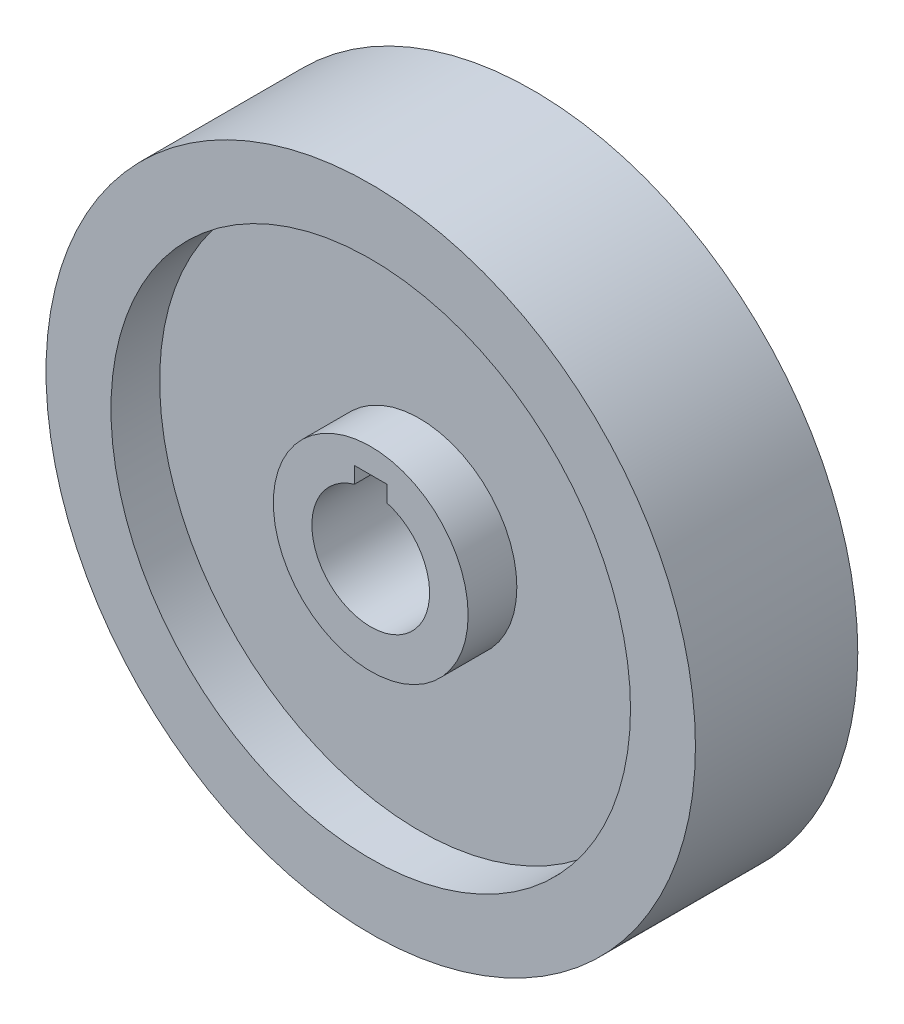
ISO-10303-21;
HEADER;
FILE_DESCRIPTION(('STEP AP214'),'2;1');
FILE_NAME('part.step','',(''),(''),'','','');
FILE_SCHEMA(('AUTOMOTIVE_DESIGN { 1 0 10303 214 1 1 1 1 }'));
ENDSEC;
DATA;
#1=APPLICATION_CONTEXT('core data for automotive mechanical design processes');
#2=APPLICATION_PROTOCOL_DEFINITION('international standard','automotive_design',2000,#1);
#3=PRODUCT_CONTEXT('',#1,'mechanical');
#4=PRODUCT('Part','Part','',(#3));
#5=PRODUCT_RELATED_PRODUCT_CATEGORY('part','',(#4));
#6=PRODUCT_DEFINITION_FORMATION('','',#4);
#7=PRODUCT_DEFINITION_CONTEXT('part definition',#1,'design');
#8=PRODUCT_DEFINITION('design','',#6,#7);
#9=PRODUCT_DEFINITION_SHAPE('','',#8);
#10=(LENGTH_UNIT() NAMED_UNIT(*) SI_UNIT(.MILLI.,.METRE.));
#11=(NAMED_UNIT(*) PLANE_ANGLE_UNIT() SI_UNIT($,.RADIAN.));
#12=(NAMED_UNIT(*) SI_UNIT($,.STERADIAN.) SOLID_ANGLE_UNIT());
#13=UNCERTAINTY_MEASURE_WITH_UNIT(LENGTH_MEASURE(1.E-05),#10,'distance_accuracy_value','');
#14=(GEOMETRIC_REPRESENTATION_CONTEXT(3) GLOBAL_UNCERTAINTY_ASSIGNED_CONTEXT((#13)) GLOBAL_UNIT_ASSIGNED_CONTEXT((#10,
#11,#12)) REPRESENTATION_CONTEXT('',''));
#15=CARTESIAN_POINT('',(0.,0.,0.));
#16=DIRECTION('',(0.,0.,1.));
#17=DIRECTION('',(1.,0.,0.));
#18=AXIS2_PLACEMENT_3D('',#15,#16,#17);
#19=CARTESIAN_POINT('',(0.,0.,34.2145149025101));
#20=DIRECTION('',(0.,0.,1.));
#21=DIRECTION('',(1.,0.,0.));
#22=AXIS2_PLACEMENT_3D('',#19,#20,#21);
#23=CYLINDRICAL_SURFACE('',#22,19.05);
#24=CARTESIAN_POINT('',(0.,0.,-6.35));
#25=DIRECTION('',(0.,0.,1.));
#26=DIRECTION('',(1.,0.,0.));
#27=AXIS2_PLACEMENT_3D('',#24,#25,#26);
#28=CIRCLE('',#27,19.05);
#29=CARTESIAN_POINT('',(19.05,0.,-6.35));
#30=VERTEX_POINT('',#29);
#31=EDGE_CURVE('E122',#30,#30,#28,.T.);
#32=ORIENTED_EDGE('',*,*,#31,.F.);
#33=EDGE_LOOP('',(#32));
#34=FACE_BOUND('',#33,.T.);
#35=CARTESIAN_POINT('',(0.,0.,-15.875));
#36=DIRECTION('',(0.,0.,1.));
#37=DIRECTION('',(1.,0.,0.));
#38=AXIS2_PLACEMENT_3D('',#35,#36,#37);
#39=CIRCLE('',#38,19.05);
#40=CARTESIAN_POINT('',(19.05,0.,-15.875));
#41=VERTEX_POINT('',#40);
#42=EDGE_CURVE('E11',#41,#41,#39,.T.);
#43=ORIENTED_EDGE('',*,*,#42,.T.);
#44=EDGE_LOOP('',(#43));
#45=FACE_BOUND('',#44,.T.);
#46=ADVANCED_FACE('F35',(#34,#45),#23,.T.);
#47=CARTESIAN_POINT('',(0.,11.509375,-15.875));
#48=DIRECTION('',(0.,0.,1.));
#49=DIRECTION('',(1.,0.,0.));
#50=AXIS2_PLACEMENT_3D('',#47,#48,#49);
#51=PLANE('',#50);
#52=ORIENTED_EDGE('',*,*,#42,.F.);
#53=EDGE_LOOP('',(#52));
#54=FACE_BOUND('',#53,.T.);
#55=CARTESIAN_POINT('',(0.,0.,-15.875));
#56=DIRECTION('',(0.,0.,1.));
#57=DIRECTION('',(1.,0.,0.));
#58=AXIS2_PLACEMENT_3D('',#55,#56,#57);
#59=CIRCLE('',#58,11.509375);
#60=CARTESIAN_POINT('',(-3.175,11.0627793926583,-15.875));
#61=VERTEX_POINT('',#60);
#62=CARTESIAN_POINT('',(3.175,11.0627793926583,-15.875));
#63=VERTEX_POINT('',#62);
#64=EDGE_CURVE('E42',#61,#63,#59,.T.);
#65=ORIENTED_EDGE('',*,*,#64,.T.);
#66=DIRECTION('',(0.,-1.,0.));
#67=VECTOR('',#66,1.);
#68=CARTESIAN_POINT('',(3.175,14.2377793926583,-15.875));
#69=LINE('',#68,#67);
#70=CARTESIAN_POINT('',(3.175,14.2377793926583,-15.875));
#71=VERTEX_POINT('',#70);
#72=EDGE_CURVE('E78',#71,#63,#69,.T.);
#73=ORIENTED_EDGE('',*,*,#72,.F.);
#74=DIRECTION('',(1.,0.,0.));
#75=VECTOR('',#74,1.);
#76=CARTESIAN_POINT('',(-3.175,14.2377793926583,-15.875));
#77=LINE('',#76,#75);
#78=CARTESIAN_POINT('',(-3.175,14.2377793926583,-15.875));
#79=VERTEX_POINT('',#78);
#80=EDGE_CURVE('E92',#79,#71,#77,.T.);
#81=ORIENTED_EDGE('',*,*,#80,.F.);
#82=DIRECTION('',(0.,1.,0.));
#83=VECTOR('',#82,1.);
#84=CARTESIAN_POINT('',(-3.175,11.0627793926583,-15.875));
#85=LINE('',#84,#83);
#86=EDGE_CURVE('E130',#61,#79,#85,.T.);
#87=ORIENTED_EDGE('',*,*,#86,.F.);
#88=EDGE_LOOP('',(#65,#73,#81,#87));
#89=FACE_BOUND('',#88,.T.);
#90=ADVANCED_FACE('F141',(#54,#89),#51,.F.);
#91=CARTESIAN_POINT('',(0.,0.,34.2145149025101));
#92=DIRECTION('',(0.,0.,1.));
#93=DIRECTION('',(1.,0.,0.));
#94=AXIS2_PLACEMENT_3D('',#91,#92,#93);
#95=CYLINDRICAL_SURFACE('',#94,11.509375);
#96=CARTESIAN_POINT('',(0.,0.,15.875));
#97=DIRECTION('',(0.,0.,1.));
#98=DIRECTION('',(1.,0.,0.));
#99=AXIS2_PLACEMENT_3D('',#96,#97,#98);
#100=CIRCLE('',#99,11.509375);
#101=CARTESIAN_POINT('',(-3.175,11.0627793926583,15.875));
#102=VERTEX_POINT('',#101);
#103=CARTESIAN_POINT('',(3.175,11.0627793926583,15.875));
#104=VERTEX_POINT('',#103);
#105=EDGE_CURVE('E90',#102,#104,#100,.T.);
#106=ORIENTED_EDGE('',*,*,#105,.T.);
#107=DIRECTION('',(0.,0.,-1.));
#108=VECTOR('',#107,1.);
#109=CARTESIAN_POINT('',(3.175,11.0627793926583,15.875));
#110=LINE('',#109,#108);
#111=EDGE_CURVE('E73',#104,#63,#110,.T.);
#112=ORIENTED_EDGE('',*,*,#111,.T.);
#113=ORIENTED_EDGE('',*,*,#64,.F.);
#114=DIRECTION('',(0.,0.,-1.));
#115=VECTOR('',#114,1.);
#116=CARTESIAN_POINT('',(-3.175,11.0627793926583,15.875));
#117=LINE('',#116,#115);
#118=EDGE_CURVE('E83',#102,#61,#117,.T.);
#119=ORIENTED_EDGE('',*,*,#118,.F.);
#120=EDGE_LOOP('',(#106,#112,#113,#119));
#121=FACE_BOUND('',#120,.T.);
#122=ADVANCED_FACE('F95',(#121),#95,.F.);
#123=CARTESIAN_POINT('',(0.,11.509375,15.875));
#124=DIRECTION('',(0.,0.,-1.));
#125=DIRECTION('',(-1.,0.,0.));
#126=AXIS2_PLACEMENT_3D('',#123,#124,#125);
#127=PLANE('',#126);
#128=DIRECTION('',(1.,0.,0.));
#129=VECTOR('',#128,1.);
#130=CARTESIAN_POINT('',(-3.175,14.2377793926583,15.875));
#131=LINE('',#130,#129);
#132=CARTESIAN_POINT('',(-3.175,14.2377793926583,15.875));
#133=VERTEX_POINT('',#132);
#134=CARTESIAN_POINT('',(3.175,14.2377793926583,15.875));
#135=VERTEX_POINT('',#134);
#136=EDGE_CURVE('E49',#133,#135,#131,.T.);
#137=ORIENTED_EDGE('',*,*,#136,.T.);
#138=DIRECTION('',(0.,-1.,0.));
#139=VECTOR('',#138,1.);
#140=CARTESIAN_POINT('',(3.175,14.2377793926583,15.875));
#141=LINE('',#140,#139);
#142=EDGE_CURVE('E76',#135,#104,#141,.T.);
#143=ORIENTED_EDGE('',*,*,#142,.T.);
#144=ORIENTED_EDGE('',*,*,#105,.F.);
#145=DIRECTION('',(0.,1.,0.));
#146=VECTOR('',#145,1.);
#147=CARTESIAN_POINT('',(-3.175,11.0627793926583,15.875));
#148=LINE('',#147,#146);
#149=EDGE_CURVE('E91',#102,#133,#148,.T.);
#150=ORIENTED_EDGE('',*,*,#149,.T.);
#151=EDGE_LOOP('',(#137,#143,#144,#150));
#152=FACE_BOUND('',#151,.T.);
#153=CARTESIAN_POINT('',(0.,0.,15.875));
#154=DIRECTION('',(0.,0.,1.));
#155=DIRECTION('',(1.,0.,0.));
#156=AXIS2_PLACEMENT_3D('',#153,#154,#155);
#157=CIRCLE('',#156,19.05);
#158=CARTESIAN_POINT('',(19.05,0.,15.875));
#159=VERTEX_POINT('',#158);
#160=EDGE_CURVE('E96',#159,#159,#157,.T.);
#161=ORIENTED_EDGE('',*,*,#160,.T.);
#162=EDGE_LOOP('',(#161));
#163=FACE_BOUND('',#162,.T.);
#164=ADVANCED_FACE('F87',(#152,#163),#127,.F.);
#165=CARTESIAN_POINT('',(0.,0.,34.2145149025101));
#166=DIRECTION('',(0.,0.,1.));
#167=DIRECTION('',(1.,0.,0.));
#168=AXIS2_PLACEMENT_3D('',#165,#166,#167);
#169=CYLINDRICAL_SURFACE('',#168,19.05);
#170=ORIENTED_EDGE('',*,*,#160,.F.);
#171=EDGE_LOOP('',(#170));
#172=FACE_BOUND('',#171,.T.);
#173=CARTESIAN_POINT('',(0.,0.,6.35));
#174=DIRECTION('',(0.,0.,1.));
#175=DIRECTION('',(1.,0.,0.));
#176=AXIS2_PLACEMENT_3D('',#173,#174,#175);
#177=CIRCLE('',#176,19.05);
#178=CARTESIAN_POINT('',(19.05,0.,6.35));
#179=VERTEX_POINT('',#178);
#180=EDGE_CURVE('E99',#179,#179,#177,.T.);
#181=ORIENTED_EDGE('',*,*,#180,.T.);
#182=EDGE_LOOP('',(#181));
#183=FACE_BOUND('',#182,.T.);
#184=ADVANCED_FACE('F154',(#172,#183),#169,.T.);
#185=CARTESIAN_POINT('',(0.,19.05,6.35));
#186=DIRECTION('',(0.,0.,-1.));
#187=DIRECTION('',(-1.,0.,0.));
#188=AXIS2_PLACEMENT_3D('',#185,#186,#187);
#189=PLANE('',#188);
#190=ORIENTED_EDGE('',*,*,#180,.F.);
#191=EDGE_LOOP('',(#190));
#192=FACE_BOUND('',#191,.T.);
#193=CARTESIAN_POINT('',(0.,0.,6.35));
#194=DIRECTION('',(0.,0.,1.));
#195=DIRECTION('',(1.,0.,0.));
#196=AXIS2_PLACEMENT_3D('',#193,#194,#195);
#197=CIRCLE('',#196,50.8);
#198=CARTESIAN_POINT('',(50.8,0.,6.35));
#199=VERTEX_POINT('',#198);
#200=EDGE_CURVE('E104',#199,#199,#197,.T.);
#201=ORIENTED_EDGE('',*,*,#200,.T.);
#202=EDGE_LOOP('',(#201));
#203=FACE_BOUND('',#202,.T.);
#204=ADVANCED_FACE('F157',(#192,#203),#189,.F.);
#205=CARTESIAN_POINT('',(0.,0.,34.2145149025101));
#206=DIRECTION('',(0.,0.,1.));
#207=DIRECTION('',(1.,0.,0.));
#208=AXIS2_PLACEMENT_3D('',#205,#206,#207);
#209=CYLINDRICAL_SURFACE('',#208,50.8);
#210=ORIENTED_EDGE('',*,*,#200,.F.);
#211=EDGE_LOOP('',(#210));
#212=FACE_BOUND('',#211,.T.);
#213=CARTESIAN_POINT('',(0.,0.,15.875));
#214=DIRECTION('',(0.,0.,1.));
#215=DIRECTION('',(1.,0.,0.));
#216=AXIS2_PLACEMENT_3D('',#213,#214,#215);
#217=CIRCLE('',#216,50.8);
#218=CARTESIAN_POINT('',(50.8,0.,15.875));
#219=VERTEX_POINT('',#218);
#220=EDGE_CURVE('E107',#219,#219,#217,.T.);
#221=ORIENTED_EDGE('',*,*,#220,.T.);
#222=EDGE_LOOP('',(#221));
#223=FACE_BOUND('',#222,.T.);
#224=ADVANCED_FACE('F161',(#212,#223),#209,.F.);
#225=CARTESIAN_POINT('',(0.,50.8,15.875));
#226=DIRECTION('',(0.,0.,-1.));
#227=DIRECTION('',(-1.,0.,0.));
#228=AXIS2_PLACEMENT_3D('',#225,#226,#227);
#229=PLANE('',#228);
#230=ORIENTED_EDGE('',*,*,#220,.F.);
#231=EDGE_LOOP('',(#230));
#232=FACE_BOUND('',#231,.T.);
#233=CARTESIAN_POINT('',(0.,0.,15.875));
#234=DIRECTION('',(0.,0.,1.));
#235=DIRECTION('',(1.,0.,0.));
#236=AXIS2_PLACEMENT_3D('',#233,#234,#235);
#237=CIRCLE('',#236,63.5);
#238=CARTESIAN_POINT('',(63.5,0.,15.875));
#239=VERTEX_POINT('',#238);
#240=EDGE_CURVE('E110',#239,#239,#237,.T.);
#241=ORIENTED_EDGE('',*,*,#240,.T.);
#242=EDGE_LOOP('',(#241));
#243=FACE_BOUND('',#242,.T.);
#244=ADVANCED_FACE('F165',(#232,#243),#229,.F.);
#245=CARTESIAN_POINT('',(0.,0.,34.2145149025101));
#246=DIRECTION('',(0.,0.,1.));
#247=DIRECTION('',(1.,0.,0.));
#248=AXIS2_PLACEMENT_3D('',#245,#246,#247);
#249=CYLINDRICAL_SURFACE('',#248,63.5);
#250=ORIENTED_EDGE('',*,*,#240,.F.);
#251=EDGE_LOOP('',(#250));
#252=FACE_BOUND('',#251,.T.);
#253=CARTESIAN_POINT('',(0.,0.,-15.875));
#254=DIRECTION('',(0.,0.,1.));
#255=DIRECTION('',(1.,0.,0.));
#256=AXIS2_PLACEMENT_3D('',#253,#254,#255);
#257=CIRCLE('',#256,63.5);
#258=CARTESIAN_POINT('',(63.5,0.,-15.875));
#259=VERTEX_POINT('',#258);
#260=EDGE_CURVE('E113',#259,#259,#257,.T.);
#261=ORIENTED_EDGE('',*,*,#260,.T.);
#262=EDGE_LOOP('',(#261));
#263=FACE_BOUND('',#262,.T.);
#264=ADVANCED_FACE('F169',(#252,#263),#249,.T.);
#265=CARTESIAN_POINT('',(0.,50.8,-15.875));
#266=DIRECTION('',(0.,0.,1.));
#267=DIRECTION('',(1.,0.,0.));
#268=AXIS2_PLACEMENT_3D('',#265,#266,#267);
#269=PLANE('',#268);
#270=ORIENTED_EDGE('',*,*,#260,.F.);
#271=EDGE_LOOP('',(#270));
#272=FACE_BOUND('',#271,.T.);
#273=CARTESIAN_POINT('',(0.,0.,-15.875));
#274=DIRECTION('',(0.,0.,1.));
#275=DIRECTION('',(1.,0.,0.));
#276=AXIS2_PLACEMENT_3D('',#273,#274,#275);
#277=CIRCLE('',#276,50.8);
#278=CARTESIAN_POINT('',(50.8,0.,-15.875));
#279=VERTEX_POINT('',#278);
#280=EDGE_CURVE('E116',#279,#279,#277,.T.);
#281=ORIENTED_EDGE('',*,*,#280,.T.);
#282=EDGE_LOOP('',(#281));
#283=FACE_BOUND('',#282,.T.);
#284=ADVANCED_FACE('F173',(#272,#283),#269,.F.);
#285=CARTESIAN_POINT('',(0.,0.,34.2145149025101));
#286=DIRECTION('',(0.,0.,1.));
#287=DIRECTION('',(1.,0.,0.));
#288=AXIS2_PLACEMENT_3D('',#285,#286,#287);
#289=CYLINDRICAL_SURFACE('',#288,50.8);
#290=ORIENTED_EDGE('',*,*,#280,.F.);
#291=EDGE_LOOP('',(#290));
#292=FACE_BOUND('',#291,.T.);
#293=CARTESIAN_POINT('',(0.,0.,-6.35));
#294=DIRECTION('',(0.,0.,1.));
#295=DIRECTION('',(1.,0.,0.));
#296=AXIS2_PLACEMENT_3D('',#293,#294,#295);
#297=CIRCLE('',#296,50.8);
#298=CARTESIAN_POINT('',(50.8,0.,-6.35));
#299=VERTEX_POINT('',#298);
#300=EDGE_CURVE('E119',#299,#299,#297,.T.);
#301=ORIENTED_EDGE('',*,*,#300,.T.);
#302=EDGE_LOOP('',(#301));
#303=FACE_BOUND('',#302,.T.);
#304=ADVANCED_FACE('F177',(#292,#303),#289,.F.);
#305=CARTESIAN_POINT('',(0.,19.05,-6.35));
#306=DIRECTION('',(0.,0.,1.));
#307=DIRECTION('',(1.,0.,0.));
#308=AXIS2_PLACEMENT_3D('',#305,#306,#307);
#309=PLANE('',#308);
#310=ORIENTED_EDGE('',*,*,#300,.F.);
#311=EDGE_LOOP('',(#310));
#312=FACE_BOUND('',#311,.T.);
#313=ORIENTED_EDGE('',*,*,#31,.T.);
#314=EDGE_LOOP('',(#313));
#315=FACE_BOUND('',#314,.T.);
#316=ADVANCED_FACE('F181',(#312,#315),#309,.F.);
#317=CARTESIAN_POINT('',(3.175,14.2377793926583,15.875));
#318=DIRECTION('',(1.,0.,0.));
#319=DIRECTION('',(0.,0.,-1.));
#320=AXIS2_PLACEMENT_3D('',#317,#318,#319);
#321=PLANE('',#320);
#322=ORIENTED_EDGE('',*,*,#72,.T.);
#323=ORIENTED_EDGE('',*,*,#111,.F.);
#324=ORIENTED_EDGE('',*,*,#142,.F.);
#325=DIRECTION('',(0.,0.,-1.));
#326=VECTOR('',#325,1.);
#327=CARTESIAN_POINT('',(3.175,14.2377793926583,15.875));
#328=LINE('',#327,#326);
#329=EDGE_CURVE('E55',#135,#71,#328,.T.);
#330=ORIENTED_EDGE('',*,*,#329,.T.);
#331=EDGE_LOOP('',(#322,#323,#324,#330));
#332=FACE_BOUND('',#331,.T.);
#333=ADVANCED_FACE('F75',(#332),#321,.F.);
#334=CARTESIAN_POINT('',(-3.175,14.2377793926583,15.875));
#335=DIRECTION('',(0.,1.,0.));
#336=DIRECTION('',(0.,0.,1.));
#337=AXIS2_PLACEMENT_3D('',#334,#335,#336);
#338=PLANE('',#337);
#339=ORIENTED_EDGE('',*,*,#80,.T.);
#340=ORIENTED_EDGE('',*,*,#329,.F.);
#341=ORIENTED_EDGE('',*,*,#136,.F.);
#342=DIRECTION('',(0.,0.,-1.));
#343=VECTOR('',#342,1.);
#344=CARTESIAN_POINT('',(-3.175,14.2377793926583,15.875));
#345=LINE('',#344,#343);
#346=EDGE_CURVE('E126',#133,#79,#345,.T.);
#347=ORIENTED_EDGE('',*,*,#346,.T.);
#348=EDGE_LOOP('',(#339,#340,#341,#347));
#349=FACE_BOUND('',#348,.T.);
#350=ADVANCED_FACE('F139',(#349),#338,.F.);
#351=CARTESIAN_POINT('',(-3.175,11.0627793926583,15.875));
#352=DIRECTION('',(-1.,0.,0.));
#353=DIRECTION('',(0.,0.,1.));
#354=AXIS2_PLACEMENT_3D('',#351,#352,#353);
#355=PLANE('',#354);
#356=ORIENTED_EDGE('',*,*,#86,.T.);
#357=ORIENTED_EDGE('',*,*,#346,.F.);
#358=ORIENTED_EDGE('',*,*,#149,.F.);
#359=ORIENTED_EDGE('',*,*,#118,.T.);
#360=EDGE_LOOP('',(#356,#357,#358,#359));
#361=FACE_BOUND('',#360,.T.);
#362=ADVANCED_FACE('F136',(#361),#355,.F.);
#363=CLOSED_SHELL('',(#46,#90,#122,#164,#184,#204,#224,#244,#264,#284,#304,#316,#333,#350,#362));
#364=MANIFOLD_SOLID_BREP('B2',#363);
#365=ADVANCED_BREP_SHAPE_REPRESENTATION('',(#18,#364),#14);
#366=SHAPE_DEFINITION_REPRESENTATION(#9,#365);
ENDSEC;
END-ISO-10303-21;
